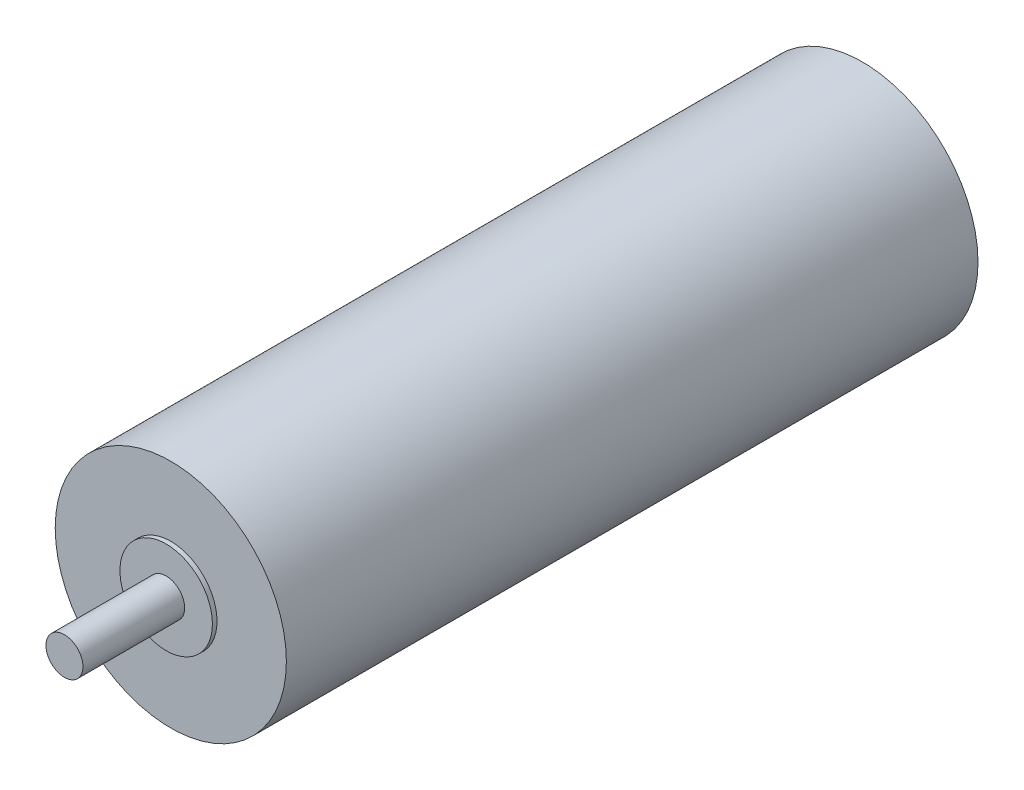
ISO-10303-21;
HEADER;
FILE_DESCRIPTION(('STEP AP214'),'2;1');
FILE_NAME('part.step','',(''),(''),'','','');
FILE_SCHEMA(('AUTOMOTIVE_DESIGN { 1 0 10303 214 1 1 1 1 }'));
ENDSEC;
DATA;
#1=APPLICATION_CONTEXT('core data for automotive mechanical design processes');
#2=APPLICATION_PROTOCOL_DEFINITION('international standard','automotive_design',2000,#1);
#3=PRODUCT_CONTEXT('',#1,'mechanical');
#4=PRODUCT('Part','Part','',(#3));
#5=PRODUCT_RELATED_PRODUCT_CATEGORY('part','',(#4));
#6=PRODUCT_DEFINITION_FORMATION('','',#4);
#7=PRODUCT_DEFINITION_CONTEXT('part definition',#1,'design');
#8=PRODUCT_DEFINITION('design','',#6,#7);
#9=PRODUCT_DEFINITION_SHAPE('','',#8);
#10=(LENGTH_UNIT() NAMED_UNIT(*) SI_UNIT(.MILLI.,.METRE.));
#11=(NAMED_UNIT(*) PLANE_ANGLE_UNIT() SI_UNIT($,.RADIAN.));
#12=(NAMED_UNIT(*) SI_UNIT($,.STERADIAN.) SOLID_ANGLE_UNIT());
#13=UNCERTAINTY_MEASURE_WITH_UNIT(LENGTH_MEASURE(1.E-05),#10,'distance_accuracy_value','');
#14=(GEOMETRIC_REPRESENTATION_CONTEXT(3) GLOBAL_UNCERTAINTY_ASSIGNED_CONTEXT((#13)) GLOBAL_UNIT_ASSIGNED_CONTEXT((#10,
#11,#12)) REPRESENTATION_CONTEXT('',''));
#15=CARTESIAN_POINT('',(0.,0.,0.));
#16=DIRECTION('',(0.,0.,1.));
#17=DIRECTION('',(1.,0.,0.));
#18=AXIS2_PLACEMENT_3D('',#15,#16,#17);
#19=CARTESIAN_POINT('',(0.,0.,74.8));
#20=DIRECTION('',(0.,0.,-1.));
#21=DIRECTION('',(-1.,0.,0.));
#22=AXIS2_PLACEMENT_3D('',#19,#20,#21);
#23=CYLINDRICAL_SURFACE('',#22,12.5);
#24=CARTESIAN_POINT('',(0.,0.,74.8));
#25=DIRECTION('',(0.,0.,1.));
#26=DIRECTION('',(1.,0.,0.));
#27=AXIS2_PLACEMENT_3D('',#24,#25,#26);
#28=CIRCLE('',#27,12.5);
#29=CARTESIAN_POINT('',(12.5,0.,74.8));
#30=VERTEX_POINT('',#29);
#31=EDGE_CURVE('E51',#30,#30,#28,.T.);
#32=ORIENTED_EDGE('',*,*,#31,.F.);
#33=EDGE_LOOP('',(#32));
#34=FACE_BOUND('',#33,.T.);
#35=CARTESIAN_POINT('',(0.,0.,0.));
#36=DIRECTION('',(0.,0.,1.));
#37=DIRECTION('',(1.,0.,0.));
#38=AXIS2_PLACEMENT_3D('',#35,#36,#37);
#39=CIRCLE('',#38,12.5);
#40=CARTESIAN_POINT('',(12.5,0.,0.));
#41=VERTEX_POINT('',#40);
#42=EDGE_CURVE('E40',#41,#41,#39,.T.);
#43=ORIENTED_EDGE('',*,*,#42,.T.);
#44=EDGE_LOOP('',(#43));
#45=FACE_BOUND('',#44,.T.);
#46=ADVANCED_FACE('F37',(#34,#45),#23,.T.);
#47=CARTESIAN_POINT('',(0.,0.,74.8));
#48=DIRECTION('',(0.,0.,1.));
#49=DIRECTION('',(1.,0.,0.));
#50=AXIS2_PLACEMENT_3D('',#47,#48,#49);
#51=PLANE('',#50);
#52=CARTESIAN_POINT('',(0.,0.,74.8));
#53=DIRECTION('',(0.,0.,1.));
#54=DIRECTION('',(1.,0.,0.));
#55=AXIS2_PLACEMENT_3D('',#52,#53,#54);
#56=CIRCLE('',#55,5.);
#57=CARTESIAN_POINT('',(5.,0.,74.8));
#58=VERTEX_POINT('',#57);
#59=EDGE_CURVE('E45',#58,#58,#56,.T.);
#60=ORIENTED_EDGE('',*,*,#59,.F.);
#61=EDGE_LOOP('',(#60));
#62=FACE_BOUND('',#61,.T.);
#63=ORIENTED_EDGE('',*,*,#31,.T.);
#64=EDGE_LOOP('',(#63));
#65=FACE_BOUND('',#64,.T.);
#66=ADVANCED_FACE('F71',(#62,#65),#51,.T.);
#67=CARTESIAN_POINT('',(0.,0.,0.));
#68=DIRECTION('',(0.,0.,1.));
#69=DIRECTION('',(1.,0.,0.));
#70=AXIS2_PLACEMENT_3D('',#67,#68,#69);
#71=PLANE('',#70);
#72=ORIENTED_EDGE('',*,*,#42,.F.);
#73=EDGE_LOOP('',(#72));
#74=FACE_BOUND('',#73,.T.);
#75=ADVANCED_FACE('F68',(#74),#71,.F.);
#76=CARTESIAN_POINT('',(0.,0.,75.3));
#77=DIRECTION('',(0.,0.,-1.));
#78=DIRECTION('',(-1.,0.,0.));
#79=AXIS2_PLACEMENT_3D('',#76,#77,#78);
#80=CYLINDRICAL_SURFACE('',#79,5.);
#81=CARTESIAN_POINT('',(0.,0.,75.3));
#82=DIRECTION('',(0.,0.,1.));
#83=DIRECTION('',(1.,0.,0.));
#84=AXIS2_PLACEMENT_3D('',#81,#82,#83);
#85=CIRCLE('',#84,5.);
#86=CARTESIAN_POINT('',(5.,0.,75.3));
#87=VERTEX_POINT('',#86);
#88=EDGE_CURVE('E56',#87,#87,#85,.T.);
#89=ORIENTED_EDGE('',*,*,#88,.F.);
#90=EDGE_LOOP('',(#89));
#91=FACE_BOUND('',#90,.T.);
#92=ORIENTED_EDGE('',*,*,#59,.T.);
#93=EDGE_LOOP('',(#92));
#94=FACE_BOUND('',#93,.T.);
#95=ADVANCED_FACE('F70',(#91,#94),#80,.T.);
#96=CARTESIAN_POINT('',(0.,0.,75.3));
#97=DIRECTION('',(0.,0.,1.));
#98=DIRECTION('',(1.,0.,0.));
#99=AXIS2_PLACEMENT_3D('',#96,#97,#98);
#100=PLANE('',#99);
#101=CARTESIAN_POINT('',(0.,0.,75.3));
#102=DIRECTION('',(0.,0.,1.));
#103=DIRECTION('',(1.,0.,0.));
#104=AXIS2_PLACEMENT_3D('',#101,#102,#103);
#105=CIRCLE('',#104,2.);
#106=CARTESIAN_POINT('',(2.,0.,75.3));
#107=VERTEX_POINT('',#106);
#108=EDGE_CURVE('E10',#107,#107,#105,.T.);
#109=ORIENTED_EDGE('',*,*,#108,.F.);
#110=EDGE_LOOP('',(#109));
#111=FACE_BOUND('',#110,.T.);
#112=ORIENTED_EDGE('',*,*,#88,.T.);
#113=EDGE_LOOP('',(#112));
#114=FACE_BOUND('',#113,.T.);
#115=ADVANCED_FACE('F76',(#111,#114),#100,.T.);
#116=CARTESIAN_POINT('',(0.,0.,86.3));
#117=DIRECTION('',(0.,0.,-1.));
#118=DIRECTION('',(-1.,0.,0.));
#119=AXIS2_PLACEMENT_3D('',#116,#117,#118);
#120=CYLINDRICAL_SURFACE('',#119,2.);
#121=CARTESIAN_POINT('',(0.,0.,86.3));
#122=DIRECTION('',(0.,0.,1.));
#123=DIRECTION('',(1.,0.,0.));
#124=AXIS2_PLACEMENT_3D('',#121,#122,#123);
#125=CIRCLE('',#124,2.);
#126=CARTESIAN_POINT('',(2.,0.,86.3));
#127=VERTEX_POINT('',#126);
#128=EDGE_CURVE('E55',#127,#127,#125,.T.);
#129=ORIENTED_EDGE('',*,*,#128,.F.);
#130=EDGE_LOOP('',(#129));
#131=FACE_BOUND('',#130,.T.);
#132=ORIENTED_EDGE('',*,*,#108,.T.);
#133=EDGE_LOOP('',(#132));
#134=FACE_BOUND('',#133,.T.);
#135=ADVANCED_FACE('F106',(#131,#134),#120,.T.);
#136=CARTESIAN_POINT('',(0.,0.,86.3));
#137=DIRECTION('',(0.,0.,1.));
#138=DIRECTION('',(1.,0.,0.));
#139=AXIS2_PLACEMENT_3D('',#136,#137,#138);
#140=PLANE('',#139);
#141=ORIENTED_EDGE('',*,*,#128,.T.);
#142=EDGE_LOOP('',(#141));
#143=FACE_BOUND('',#142,.T.);
#144=ADVANCED_FACE('F116',(#143),#140,.T.);
#145=CLOSED_SHELL('',(#46,#66,#75,#95,#115,#135,#144));
#146=MANIFOLD_SOLID_BREP('B2',#145);
#147=ADVANCED_BREP_SHAPE_REPRESENTATION('',(#18,#146),#14);
#148=SHAPE_DEFINITION_REPRESENTATION(#9,#147);
ENDSEC;
END-ISO-10303-21;
